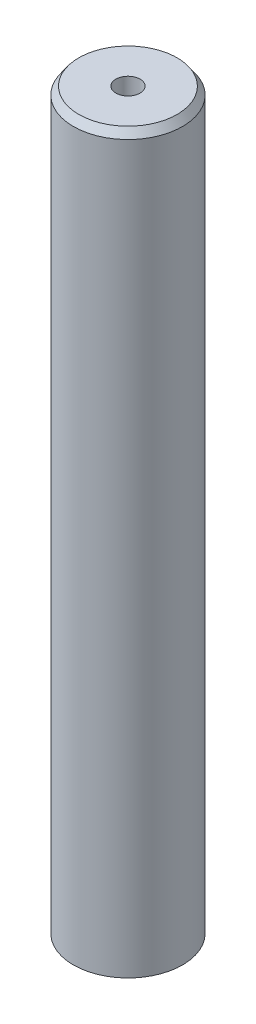
ISO-10303-21;
HEADER;
FILE_DESCRIPTION(('STEP AP214'),'2;1');
FILE_NAME('part.step','',(''),(''),'','','');
FILE_SCHEMA(('AUTOMOTIVE_DESIGN { 1 0 10303 214 1 1 1 1 }'));
ENDSEC;
DATA;
#1=APPLICATION_CONTEXT('core data for automotive mechanical design processes');
#2=APPLICATION_PROTOCOL_DEFINITION('international standard','automotive_design',2000,#1);
#3=PRODUCT_CONTEXT('',#1,'mechanical');
#4=PRODUCT('Part','Part','',(#3));
#5=PRODUCT_RELATED_PRODUCT_CATEGORY('part','',(#4));
#6=PRODUCT_DEFINITION_FORMATION('','',#4);
#7=PRODUCT_DEFINITION_CONTEXT('part definition',#1,'design');
#8=PRODUCT_DEFINITION('design','',#6,#7);
#9=PRODUCT_DEFINITION_SHAPE('','',#8);
#10=(LENGTH_UNIT() NAMED_UNIT(*) SI_UNIT(.MILLI.,.METRE.));
#11=(NAMED_UNIT(*) PLANE_ANGLE_UNIT() SI_UNIT($,.RADIAN.));
#12=(NAMED_UNIT(*) SI_UNIT($,.STERADIAN.) SOLID_ANGLE_UNIT());
#13=UNCERTAINTY_MEASURE_WITH_UNIT(LENGTH_MEASURE(1.E-05),#10,'distance_accuracy_value','');
#14=(GEOMETRIC_REPRESENTATION_CONTEXT(3) GLOBAL_UNCERTAINTY_ASSIGNED_CONTEXT((#13)) GLOBAL_UNIT_ASSIGNED_CONTEXT((#10,
#11,#12)) REPRESENTATION_CONTEXT('',''));
#15=CARTESIAN_POINT('',(0.,0.,0.));
#16=DIRECTION('',(0.,0.,1.));
#17=DIRECTION('',(1.,0.,0.));
#18=AXIS2_PLACEMENT_3D('',#15,#16,#17);
#19=CARTESIAN_POINT('',(0.,101.5985864944,0.));
#20=DIRECTION('',(0.,-1.,0.));
#21=DIRECTION('',(0.,0.,-1.));
#22=AXIS2_PLACEMENT_3D('',#19,#20,#21);
#23=CYLINDRICAL_SURFACE('',#22,7.5);
#24=CARTESIAN_POINT('',(0.,100.539143216712,0.));
#25=DIRECTION('',(0.,1.,0.));
#26=DIRECTION('',(0.,0.,1.));
#27=AXIS2_PLACEMENT_3D('',#24,#25,#26);
#28=CIRCLE('',#27,7.5);
#29=CARTESIAN_POINT('',(0.,100.539143216712,7.5));
#30=VERTEX_POINT('',#29);
#31=EDGE_CURVE('E50',#30,#30,#28,.F.);
#32=ORIENTED_EDGE('',*,*,#31,.T.);
#33=EDGE_LOOP('',(#32));
#34=FACE_BOUND('',#33,.T.);
#35=CARTESIAN_POINT('',(0.,0.748312403439907,0.));
#36=DIRECTION('',(0.,1.,0.));
#37=DIRECTION('',(0.,0.,1.));
#38=AXIS2_PLACEMENT_3D('',#35,#36,#37);
#39=CIRCLE('',#38,7.5);
#40=CARTESIAN_POINT('',(0.,0.748312403439907,7.5));
#41=VERTEX_POINT('',#40);
#42=EDGE_CURVE('E51',#41,#41,#39,.T.);
#43=ORIENTED_EDGE('',*,*,#42,.T.);
#44=EDGE_LOOP('',(#43));
#45=FACE_BOUND('',#44,.T.);
#46=ADVANCED_FACE('F39',(#34,#45),#23,.T.);
#47=CARTESIAN_POINT('',(0.,101.5985864944,0.));
#48=DIRECTION('',(0.,1.,0.));
#49=DIRECTION('',(0.,0.,1.));
#50=AXIS2_PLACEMENT_3D('',#47,#48,#49);
#51=PLANE('',#50);
#52=CARTESIAN_POINT('',(0.,101.5985864944,0.));
#53=DIRECTION('',(0.,1.,0.));
#54=DIRECTION('',(0.,0.,1.));
#55=AXIS2_PLACEMENT_3D('',#52,#53,#54);
#56=CIRCLE('',#55,6.75168759656008);
#57=CARTESIAN_POINT('',(0.,101.5985864944,6.75168759656008));
#58=VERTEX_POINT('',#57);
#59=EDGE_CURVE('E54',#58,#58,#56,.T.);
#60=ORIENTED_EDGE('',*,*,#59,.T.);
#61=EDGE_LOOP('',(#60));
#62=FACE_BOUND('',#61,.T.);
#63=CARTESIAN_POINT('',(0.,101.5985864944,0.));
#64=DIRECTION('',(0.,1.,0.));
#65=DIRECTION('',(0.,0.,1.));
#66=AXIS2_PLACEMENT_3D('',#63,#64,#65);
#67=CIRCLE('',#66,1.66659846894422);
#68=CARTESIAN_POINT('',(0.,101.5985864944,1.66659846894422));
#69=VERTEX_POINT('',#68);
#70=EDGE_CURVE('E58',#69,#69,#67,.T.);
#71=ORIENTED_EDGE('',*,*,#70,.F.);
#72=EDGE_LOOP('',(#71));
#73=FACE_BOUND('',#72,.T.);
#74=ADVANCED_FACE('F69',(#62,#73),#51,.T.);
#75=CARTESIAN_POINT('',(0.,0.,0.));
#76=DIRECTION('',(0.,1.,0.));
#77=DIRECTION('',(0.,0.,1.));
#78=AXIS2_PLACEMENT_3D('',#75,#76,#77);
#79=PLANE('',#78);
#80=CARTESIAN_POINT('',(0.,0.,0.));
#81=DIRECTION('',(0.,1.,0.));
#82=DIRECTION('',(0.,0.,1.));
#83=AXIS2_PLACEMENT_3D('',#80,#81,#82);
#84=CIRCLE('',#83,6.44055672231286);
#85=CARTESIAN_POINT('',(0.,0.,6.44055672231286));
#86=VERTEX_POINT('',#85);
#87=EDGE_CURVE('E10',#86,#86,#84,.F.);
#88=ORIENTED_EDGE('',*,*,#87,.T.);
#89=EDGE_LOOP('',(#88));
#90=FACE_BOUND('',#89,.T.);
#91=CARTESIAN_POINT('',(0.,0.,0.));
#92=DIRECTION('',(0.,1.,0.));
#93=DIRECTION('',(0.,0.,1.));
#94=AXIS2_PLACEMENT_3D('',#91,#92,#93);
#95=CIRCLE('',#94,1.66659846894422);
#96=CARTESIAN_POINT('',(0.,0.,1.66659846894422));
#97=VERTEX_POINT('',#96);
#98=EDGE_CURVE('E63',#97,#97,#95,.T.);
#99=ORIENTED_EDGE('',*,*,#98,.T.);
#100=EDGE_LOOP('',(#99));
#101=FACE_BOUND('',#100,.T.);
#102=ADVANCED_FACE('F75',(#90,#101),#79,.F.);
#103=CARTESIAN_POINT('',(0.,101.5985864944,0.));
#104=DIRECTION('',(0.,-1.,0.));
#105=DIRECTION('',(0.,0.,-1.));
#106=AXIS2_PLACEMENT_3D('',#103,#104,#105);
#107=CYLINDRICAL_SURFACE('',#106,1.66659846894422);
#108=ORIENTED_EDGE('',*,*,#70,.T.);
#109=EDGE_LOOP('',(#108));
#110=FACE_BOUND('',#109,.T.);
#111=ORIENTED_EDGE('',*,*,#98,.F.);
#112=EDGE_LOOP('',(#111));
#113=FACE_BOUND('',#112,.T.);
#114=ADVANCED_FACE('F70',(#110,#113),#107,.F.);
#115=CARTESIAN_POINT('',(0.,101.5985864944,0.));
#116=DIRECTION('',(0.,-1.,0.));
#117=DIRECTION('',(0.,0.,-1.));
#118=AXIS2_PLACEMENT_3D('',#115,#116,#117);
#119=CONICAL_SURFACE('',#118,6.75168759656008,0.614959040908589);
#120=ORIENTED_EDGE('',*,*,#31,.F.);
#121=EDGE_LOOP('',(#120));
#122=FACE_BOUND('',#121,.T.);
#123=ORIENTED_EDGE('',*,*,#59,.F.);
#124=EDGE_LOOP('',(#123));
#125=FACE_BOUND('',#124,.T.);
#126=ADVANCED_FACE('F81',(#122,#125),#119,.T.);
#127=CARTESIAN_POINT('',(0.,0.748312403439907,0.));
#128=DIRECTION('',(0.,1.,0.));
#129=DIRECTION('',(0.,0.,1.));
#130=AXIS2_PLACEMENT_3D('',#127,#128,#129);
#131=CONICAL_SURFACE('',#130,7.5,0.955837285886307);
#132=ORIENTED_EDGE('',*,*,#87,.F.);
#133=EDGE_LOOP('',(#132));
#134=FACE_BOUND('',#133,.T.);
#135=ORIENTED_EDGE('',*,*,#42,.F.);
#136=EDGE_LOOP('',(#135));
#137=FACE_BOUND('',#136,.T.);
#138=ADVANCED_FACE('F45',(#134,#137),#131,.T.);
#139=CLOSED_SHELL('',(#46,#74,#102,#114,#126,#138));
#140=MANIFOLD_SOLID_BREP('B2',#139);
#141=ADVANCED_BREP_SHAPE_REPRESENTATION('',(#18,#140),#14);
#142=SHAPE_DEFINITION_REPRESENTATION(#9,#141);
ENDSEC;
END-ISO-10303-21;
